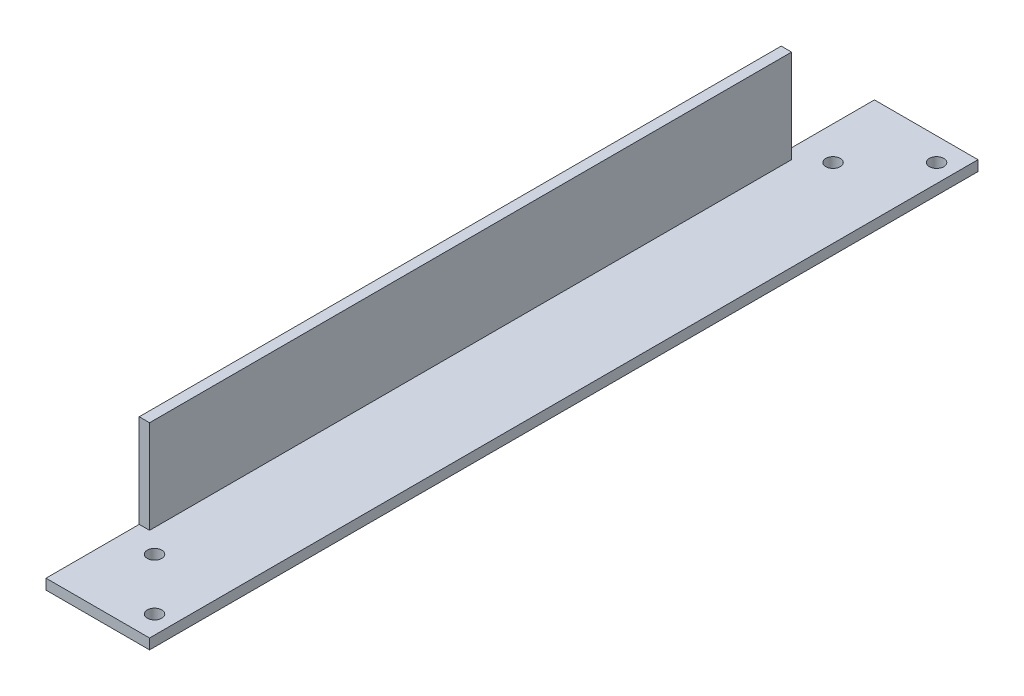
ISO-10303-21;
HEADER;
FILE_DESCRIPTION(('STEP AP214'),'2;1');
FILE_NAME('part.step','',(''),(''),'','','');
FILE_SCHEMA(('AUTOMOTIVE_DESIGN { 1 0 10303 214 1 1 1 1 }'));
ENDSEC;
DATA;
#1=APPLICATION_CONTEXT('core data for automotive mechanical design processes');
#2=APPLICATION_PROTOCOL_DEFINITION('international standard','automotive_design',2000,#1);
#3=PRODUCT_CONTEXT('',#1,'mechanical');
#4=PRODUCT('Part','Part','',(#3));
#5=PRODUCT_RELATED_PRODUCT_CATEGORY('part','',(#4));
#6=PRODUCT_DEFINITION_FORMATION('','',#4);
#7=PRODUCT_DEFINITION_CONTEXT('part definition',#1,'design');
#8=PRODUCT_DEFINITION('design','',#6,#7);
#9=PRODUCT_DEFINITION_SHAPE('','',#8);
#10=(LENGTH_UNIT() NAMED_UNIT(*) SI_UNIT(.MILLI.,.METRE.));
#11=(NAMED_UNIT(*) PLANE_ANGLE_UNIT() SI_UNIT($,.RADIAN.));
#12=(NAMED_UNIT(*) SI_UNIT($,.STERADIAN.) SOLID_ANGLE_UNIT());
#13=UNCERTAINTY_MEASURE_WITH_UNIT(LENGTH_MEASURE(1.E-05),#10,'distance_accuracy_value','');
#14=(GEOMETRIC_REPRESENTATION_CONTEXT(3) GLOBAL_UNCERTAINTY_ASSIGNED_CONTEXT((#13)) GLOBAL_UNIT_ASSIGNED_CONTEXT((#10,
#11,#12)) REPRESENTATION_CONTEXT('',''));
#15=CARTESIAN_POINT('',(0.,0.,0.));
#16=DIRECTION('',(0.,0.,1.));
#17=DIRECTION('',(1.,0.,0.));
#18=AXIS2_PLACEMENT_3D('',#15,#16,#17);
#19=CARTESIAN_POINT('',(0.,20.,160.));
#20=DIRECTION('',(1.,0.,0.));
#21=DIRECTION('',(0.,0.,-1.));
#22=AXIS2_PLACEMENT_3D('',#19,#20,#21);
#23=PLANE('',#22);
#24=DIRECTION('',(0.,0.,-1.));
#25=VECTOR('',#24,1.);
#26=CARTESIAN_POINT('',(0.,2.,160.));
#27=LINE('',#26,#25);
#28=CARTESIAN_POINT('',(0.,2.,160.));
#29=VERTEX_POINT('',#28);
#30=CARTESIAN_POINT('',(0.,2.,142.));
#31=VERTEX_POINT('',#30);
#32=EDGE_CURVE('E113',#29,#31,#27,.T.);
#33=ORIENTED_EDGE('',*,*,#32,.T.);
#34=DIRECTION('',(0.,1.,0.));
#35=VECTOR('',#34,1.);
#36=CARTESIAN_POINT('',(0.,20.,142.));
#37=LINE('',#36,#35);
#38=CARTESIAN_POINT('',(0.,20.,142.));
#39=VERTEX_POINT('',#38);
#40=EDGE_CURVE('E119',#31,#39,#37,.T.);
#41=ORIENTED_EDGE('',*,*,#40,.T.);
#42=DIRECTION('',(0.,0.,-1.));
#43=VECTOR('',#42,1.);
#44=CARTESIAN_POINT('',(0.,20.,160.));
#45=LINE('',#44,#43);
#46=CARTESIAN_POINT('',(0.,20.,18.));
#47=VERTEX_POINT('',#46);
#48=EDGE_CURVE('E158',#39,#47,#45,.T.);
#49=ORIENTED_EDGE('',*,*,#48,.T.);
#50=DIRECTION('',(0.,-1.,0.));
#51=VECTOR('',#50,1.);
#52=CARTESIAN_POINT('',(0.,20.,18.));
#53=LINE('',#52,#51);
#54=CARTESIAN_POINT('',(0.,2.,18.));
#55=VERTEX_POINT('',#54);
#56=EDGE_CURVE('E139',#47,#55,#53,.T.);
#57=ORIENTED_EDGE('',*,*,#56,.T.);
#58=DIRECTION('',(0.,0.,-1.));
#59=VECTOR('',#58,1.);
#60=CARTESIAN_POINT('',(0.,2.,0.));
#61=LINE('',#60,#59);
#62=CARTESIAN_POINT('',(0.,2.,0.));
#63=VERTEX_POINT('',#62);
#64=EDGE_CURVE('E142',#55,#63,#61,.T.);
#65=ORIENTED_EDGE('',*,*,#64,.T.);
#66=DIRECTION('',(0.,-1.,0.));
#67=VECTOR('',#66,1.);
#68=CARTESIAN_POINT('',(0.,20.,0.));
#69=LINE('',#68,#67);
#70=CARTESIAN_POINT('',(0.,0.,0.));
#71=VERTEX_POINT('',#70);
#72=EDGE_CURVE('E137',#63,#71,#69,.T.);
#73=ORIENTED_EDGE('',*,*,#72,.T.);
#74=DIRECTION('',(0.,0.,-1.));
#75=VECTOR('',#74,1.);
#76=CARTESIAN_POINT('',(0.,0.,160.));
#77=LINE('',#76,#75);
#78=CARTESIAN_POINT('',(0.,0.,160.));
#79=VERTEX_POINT('',#78);
#80=EDGE_CURVE('E11',#79,#71,#77,.T.);
#81=ORIENTED_EDGE('',*,*,#80,.F.);
#82=DIRECTION('',(0.,-1.,0.));
#83=VECTOR('',#82,1.);
#84=CARTESIAN_POINT('',(0.,20.,160.));
#85=LINE('',#84,#83);
#86=EDGE_CURVE('E79',#29,#79,#85,.T.);
#87=ORIENTED_EDGE('',*,*,#86,.F.);
#88=EDGE_LOOP('',(#33,#41,#49,#57,#65,#73,#81,#87));
#89=FACE_BOUND('',#88,.T.);
#90=ADVANCED_FACE('F39',(#89),#23,.F.);
#91=CARTESIAN_POINT('',(0.,0.,160.));
#92=DIRECTION('',(0.,1.,0.));
#93=DIRECTION('',(0.,0.,1.));
#94=AXIS2_PLACEMENT_3D('',#91,#92,#93);
#95=PLANE('',#94);
#96=CARTESIAN_POINT('',(16.48,0.,4.48000000000001));
#97=DIRECTION('',(0.,1.,0.));
#98=DIRECTION('',(1.,0.,0.));
#99=AXIS2_PLACEMENT_3D('',#96,#97,#98);
#100=CIRCLE('',#99,1.4);
#101=CARTESIAN_POINT('',(17.88,0.,4.48000000000001));
#102=VERTEX_POINT('',#101);
#103=EDGE_CURVE('E212',#102,#102,#100,.T.);
#104=ORIENTED_EDGE('',*,*,#103,.T.);
#105=EDGE_LOOP('',(#104));
#106=FACE_BOUND('',#105,.T.);
#107=CARTESIAN_POINT('',(16.48,0.,155.52));
#108=DIRECTION('',(0.,1.,0.));
#109=DIRECTION('',(-1.,0.,0.));
#110=AXIS2_PLACEMENT_3D('',#107,#108,#109);
#111=CIRCLE('',#110,1.40000000000002);
#112=CARTESIAN_POINT('',(15.08,0.,155.52));
#113=VERTEX_POINT('',#112);
#114=EDGE_CURVE('E216',#113,#113,#111,.T.);
#115=ORIENTED_EDGE('',*,*,#114,.T.);
#116=EDGE_LOOP('',(#115));
#117=FACE_BOUND('',#116,.T.);
#118=CARTESIAN_POINT('',(6.48,0.,14.48));
#119=DIRECTION('',(0.,1.,0.));
#120=DIRECTION('',(1.,0.,0.));
#121=AXIS2_PLACEMENT_3D('',#118,#119,#120);
#122=CIRCLE('',#121,1.4);
#123=CARTESIAN_POINT('',(7.88,0.,14.48));
#124=VERTEX_POINT('',#123);
#125=EDGE_CURVE('E220',#124,#124,#122,.T.);
#126=ORIENTED_EDGE('',*,*,#125,.T.);
#127=EDGE_LOOP('',(#126));
#128=FACE_BOUND('',#127,.T.);
#129=CARTESIAN_POINT('',(6.48,0.,145.52));
#130=DIRECTION('',(0.,1.,0.));
#131=DIRECTION('',(-1.,0.,0.));
#132=AXIS2_PLACEMENT_3D('',#129,#130,#131);
#133=CIRCLE('',#132,1.40000000000001);
#134=CARTESIAN_POINT('',(5.07999999999999,0.,145.52));
#135=VERTEX_POINT('',#134);
#136=EDGE_CURVE('E149',#135,#135,#133,.T.);
#137=ORIENTED_EDGE('',*,*,#136,.T.);
#138=EDGE_LOOP('',(#137));
#139=FACE_BOUND('',#138,.T.);
#140=DIRECTION('',(1.,0.,0.));
#141=VECTOR('',#140,1.);
#142=CARTESIAN_POINT('',(0.,0.,0.));
#143=LINE('',#142,#141);
#144=CARTESIAN_POINT('',(20.,0.,0.));
#145=VERTEX_POINT('',#144);
#146=EDGE_CURVE('E160',#71,#145,#143,.T.);
#147=ORIENTED_EDGE('',*,*,#146,.T.);
#148=DIRECTION('',(0.,0.,-1.));
#149=VECTOR('',#148,1.);
#150=CARTESIAN_POINT('',(20.,0.,160.));
#151=LINE('',#150,#149);
#152=CARTESIAN_POINT('',(20.,0.,160.));
#153=VERTEX_POINT('',#152);
#154=EDGE_CURVE('E46',#153,#145,#151,.T.);
#155=ORIENTED_EDGE('',*,*,#154,.F.);
#156=DIRECTION('',(1.,0.,0.));
#157=VECTOR('',#156,1.);
#158=CARTESIAN_POINT('',(0.,0.,160.));
#159=LINE('',#158,#157);
#160=EDGE_CURVE('E153',#79,#153,#159,.T.);
#161=ORIENTED_EDGE('',*,*,#160,.F.);
#162=ORIENTED_EDGE('',*,*,#80,.T.);
#163=EDGE_LOOP('',(#147,#155,#161,#162));
#164=FACE_BOUND('',#163,.T.);
#165=ADVANCED_FACE('F199',(#106,#117,#128,#139,#164),#95,.F.);
#166=CARTESIAN_POINT('',(20.,0.,160.));
#167=DIRECTION('',(-1.,0.,0.));
#168=DIRECTION('',(0.,0.,1.));
#169=AXIS2_PLACEMENT_3D('',#166,#167,#168);
#170=PLANE('',#169);
#171=DIRECTION('',(0.,1.,0.));
#172=VECTOR('',#171,1.);
#173=CARTESIAN_POINT('',(20.,0.,0.));
#174=LINE('',#173,#172);
#175=CARTESIAN_POINT('',(20.,2.,0.));
#176=VERTEX_POINT('',#175);
#177=EDGE_CURVE('E76',#145,#176,#174,.T.);
#178=ORIENTED_EDGE('',*,*,#177,.T.);
#179=DIRECTION('',(0.,0.,-1.));
#180=VECTOR('',#179,1.);
#181=CARTESIAN_POINT('',(20.,2.,160.));
#182=LINE('',#181,#180);
#183=CARTESIAN_POINT('',(20.,2.,160.));
#184=VERTEX_POINT('',#183);
#185=EDGE_CURVE('E169',#184,#176,#182,.T.);
#186=ORIENTED_EDGE('',*,*,#185,.F.);
#187=DIRECTION('',(0.,1.,0.));
#188=VECTOR('',#187,1.);
#189=CARTESIAN_POINT('',(20.,0.,160.));
#190=LINE('',#189,#188);
#191=EDGE_CURVE('E59',#153,#184,#190,.T.);
#192=ORIENTED_EDGE('',*,*,#191,.F.);
#193=ORIENTED_EDGE('',*,*,#154,.T.);
#194=EDGE_LOOP('',(#178,#186,#192,#193));
#195=FACE_BOUND('',#194,.T.);
#196=ADVANCED_FACE('F171',(#195),#170,.F.);
#197=CARTESIAN_POINT('',(20.,2.,160.));
#198=DIRECTION('',(0.,-1.,0.));
#199=DIRECTION('',(1.,0.,0.));
#200=AXIS2_PLACEMENT_3D('',#197,#198,#199);
#201=PLANE('',#200);
#202=CARTESIAN_POINT('',(16.48,2.,4.48000000000001));
#203=DIRECTION('',(0.,1.,0.));
#204=DIRECTION('',(1.,0.,0.));
#205=AXIS2_PLACEMENT_3D('',#202,#203,#204);
#206=CIRCLE('',#205,1.4);
#207=CARTESIAN_POINT('',(17.88,2.,4.48000000000001));
#208=VERTEX_POINT('',#207);
#209=EDGE_CURVE('E263',#208,#208,#206,.T.);
#210=ORIENTED_EDGE('',*,*,#209,.F.);
#211=EDGE_LOOP('',(#210));
#212=FACE_BOUND('',#211,.T.);
#213=CARTESIAN_POINT('',(16.48,2.,155.52));
#214=DIRECTION('',(0.,1.,0.));
#215=DIRECTION('',(-1.,0.,0.));
#216=AXIS2_PLACEMENT_3D('',#213,#214,#215);
#217=CIRCLE('',#216,1.40000000000002);
#218=CARTESIAN_POINT('',(15.08,2.,155.52));
#219=VERTEX_POINT('',#218);
#220=EDGE_CURVE('E257',#219,#219,#217,.T.);
#221=ORIENTED_EDGE('',*,*,#220,.F.);
#222=EDGE_LOOP('',(#221));
#223=FACE_BOUND('',#222,.T.);
#224=CARTESIAN_POINT('',(6.48,2.,14.48));
#225=DIRECTION('',(0.,1.,0.));
#226=DIRECTION('',(1.,0.,0.));
#227=AXIS2_PLACEMENT_3D('',#224,#225,#226);
#228=CIRCLE('',#227,1.4);
#229=CARTESIAN_POINT('',(7.88,2.,14.48));
#230=VERTEX_POINT('',#229);
#231=EDGE_CURVE('E253',#230,#230,#228,.T.);
#232=ORIENTED_EDGE('',*,*,#231,.F.);
#233=EDGE_LOOP('',(#232));
#234=FACE_BOUND('',#233,.T.);
#235=CARTESIAN_POINT('',(6.48,2.,145.52));
#236=DIRECTION('',(0.,1.,0.));
#237=DIRECTION('',(-1.,0.,0.));
#238=AXIS2_PLACEMENT_3D('',#235,#236,#237);
#239=CIRCLE('',#238,1.40000000000001);
#240=CARTESIAN_POINT('',(5.07999999999999,2.,145.52));
#241=VERTEX_POINT('',#240);
#242=EDGE_CURVE('E134',#241,#241,#239,.T.);
#243=ORIENTED_EDGE('',*,*,#242,.F.);
#244=EDGE_LOOP('',(#243));
#245=FACE_BOUND('',#244,.T.);
#246=DIRECTION('',(-1.,0.,0.));
#247=VECTOR('',#246,1.);
#248=CARTESIAN_POINT('',(20.,2.,0.));
#249=LINE('',#248,#247);
#250=EDGE_CURVE('E154',#176,#63,#249,.T.);
#251=ORIENTED_EDGE('',*,*,#250,.T.);
#252=ORIENTED_EDGE('',*,*,#64,.F.);
#253=DIRECTION('',(1.,0.,0.));
#254=VECTOR('',#253,1.);
#255=CARTESIAN_POINT('',(0.,2.,18.));
#256=LINE('',#255,#254);
#257=CARTESIAN_POINT('',(2.,2.,18.));
#258=VERTEX_POINT('',#257);
#259=EDGE_CURVE('E131',#55,#258,#256,.T.);
#260=ORIENTED_EDGE('',*,*,#259,.T.);
#261=DIRECTION('',(0.,0.,-1.));
#262=VECTOR('',#261,1.);
#263=CARTESIAN_POINT('',(2.,2.,160.));
#264=LINE('',#263,#262);
#265=CARTESIAN_POINT('',(2.,2.,142.));
#266=VERTEX_POINT('',#265);
#267=EDGE_CURVE('E115',#266,#258,#264,.T.);
#268=ORIENTED_EDGE('',*,*,#267,.F.);
#269=DIRECTION('',(1.,0.,0.));
#270=VECTOR('',#269,1.);
#271=CARTESIAN_POINT('',(0.,2.,142.));
#272=LINE('',#271,#270);
#273=EDGE_CURVE('E109',#31,#266,#272,.T.);
#274=ORIENTED_EDGE('',*,*,#273,.F.);
#275=ORIENTED_EDGE('',*,*,#32,.F.);
#276=DIRECTION('',(-1.,0.,0.));
#277=VECTOR('',#276,1.);
#278=CARTESIAN_POINT('',(20.,2.,160.));
#279=LINE('',#278,#277);
#280=EDGE_CURVE('E53',#184,#29,#279,.T.);
#281=ORIENTED_EDGE('',*,*,#280,.F.);
#282=ORIENTED_EDGE('',*,*,#185,.T.);
#283=EDGE_LOOP('',(#251,#252,#260,#268,#274,#275,#281,#282));
#284=FACE_BOUND('',#283,.T.);
#285=ADVANCED_FACE('F111',(#212,#223,#234,#245,#284),#201,.F.);
#286=CARTESIAN_POINT('',(2.,2.,160.));
#287=DIRECTION('',(-1.,0.,0.));
#288=DIRECTION('',(0.,0.,1.));
#289=AXIS2_PLACEMENT_3D('',#286,#287,#288);
#290=PLANE('',#289);
#291=DIRECTION('',(0.,0.,-1.));
#292=VECTOR('',#291,1.);
#293=CARTESIAN_POINT('',(2.,20.,160.));
#294=LINE('',#293,#292);
#295=CARTESIAN_POINT('',(2.,20.,142.));
#296=VERTEX_POINT('',#295);
#297=CARTESIAN_POINT('',(2.,20.,18.));
#298=VERTEX_POINT('',#297);
#299=EDGE_CURVE('E165',#296,#298,#294,.T.);
#300=ORIENTED_EDGE('',*,*,#299,.F.);
#301=DIRECTION('',(0.,1.,0.));
#302=VECTOR('',#301,1.);
#303=CARTESIAN_POINT('',(2.,20.,142.));
#304=LINE('',#303,#302);
#305=EDGE_CURVE('E129',#266,#296,#304,.T.);
#306=ORIENTED_EDGE('',*,*,#305,.F.);
#307=ORIENTED_EDGE('',*,*,#267,.T.);
#308=DIRECTION('',(0.,-1.,0.));
#309=VECTOR('',#308,1.);
#310=CARTESIAN_POINT('',(2.,20.,18.));
#311=LINE('',#310,#309);
#312=EDGE_CURVE('E143',#298,#258,#311,.T.);
#313=ORIENTED_EDGE('',*,*,#312,.F.);
#314=EDGE_LOOP('',(#300,#306,#307,#313));
#315=FACE_BOUND('',#314,.T.);
#316=ADVANCED_FACE('F187',(#315),#290,.F.);
#317=CARTESIAN_POINT('',(2.,20.,160.));
#318=DIRECTION('',(0.,-1.,0.));
#319=DIRECTION('',(0.,0.,-1.));
#320=AXIS2_PLACEMENT_3D('',#317,#318,#319);
#321=PLANE('',#320);
#322=ORIENTED_EDGE('',*,*,#48,.F.);
#323=DIRECTION('',(1.,0.,0.));
#324=VECTOR('',#323,1.);
#325=CARTESIAN_POINT('',(0.,20.,142.));
#326=LINE('',#325,#324);
#327=EDGE_CURVE('E118',#39,#296,#326,.T.);
#328=ORIENTED_EDGE('',*,*,#327,.T.);
#329=ORIENTED_EDGE('',*,*,#299,.T.);
#330=DIRECTION('',(1.,0.,0.));
#331=VECTOR('',#330,1.);
#332=CARTESIAN_POINT('',(0.,20.,18.));
#333=LINE('',#332,#331);
#334=EDGE_CURVE('E146',#47,#298,#333,.T.);
#335=ORIENTED_EDGE('',*,*,#334,.F.);
#336=EDGE_LOOP('',(#322,#328,#329,#335));
#337=FACE_BOUND('',#336,.T.);
#338=ADVANCED_FACE('F184',(#337),#321,.F.);
#339=CARTESIAN_POINT('',(0.,0.,160.));
#340=DIRECTION('',(0.,0.,1.));
#341=DIRECTION('',(1.,0.,0.));
#342=AXIS2_PLACEMENT_3D('',#339,#340,#341);
#343=PLANE('',#342);
#344=ORIENTED_EDGE('',*,*,#280,.T.);
#345=ORIENTED_EDGE('',*,*,#86,.T.);
#346=ORIENTED_EDGE('',*,*,#160,.T.);
#347=ORIENTED_EDGE('',*,*,#191,.T.);
#348=EDGE_LOOP('',(#344,#345,#346,#347));
#349=FACE_BOUND('',#348,.T.);
#350=ADVANCED_FACE('F194',(#349),#343,.T.);
#351=CARTESIAN_POINT('',(0.,0.,0.));
#352=DIRECTION('',(0.,0.,1.));
#353=DIRECTION('',(1.,0.,0.));
#354=AXIS2_PLACEMENT_3D('',#351,#352,#353);
#355=PLANE('',#354);
#356=ORIENTED_EDGE('',*,*,#72,.F.);
#357=ORIENTED_EDGE('',*,*,#250,.F.);
#358=ORIENTED_EDGE('',*,*,#177,.F.);
#359=ORIENTED_EDGE('',*,*,#146,.F.);
#360=EDGE_LOOP('',(#356,#357,#358,#359));
#361=FACE_BOUND('',#360,.T.);
#362=ADVANCED_FACE('F177',(#361),#355,.F.);
#363=CARTESIAN_POINT('',(0.,20.,18.));
#364=DIRECTION('',(0.,0.,1.));
#365=DIRECTION('',(1.,0.,0.));
#366=AXIS2_PLACEMENT_3D('',#363,#364,#365);
#367=PLANE('',#366);
#368=ORIENTED_EDGE('',*,*,#312,.T.);
#369=ORIENTED_EDGE('',*,*,#259,.F.);
#370=ORIENTED_EDGE('',*,*,#56,.F.);
#371=ORIENTED_EDGE('',*,*,#334,.T.);
#372=EDGE_LOOP('',(#368,#369,#370,#371));
#373=FACE_BOUND('',#372,.T.);
#374=ADVANCED_FACE('F181',(#373),#367,.F.);
#375=CARTESIAN_POINT('',(0.,20.,142.));
#376=DIRECTION('',(0.,0.,-1.));
#377=DIRECTION('',(-1.,0.,0.));
#378=AXIS2_PLACEMENT_3D('',#375,#376,#377);
#379=PLANE('',#378);
#380=ORIENTED_EDGE('',*,*,#305,.T.);
#381=ORIENTED_EDGE('',*,*,#327,.F.);
#382=ORIENTED_EDGE('',*,*,#40,.F.);
#383=ORIENTED_EDGE('',*,*,#273,.T.);
#384=EDGE_LOOP('',(#380,#381,#382,#383));
#385=FACE_BOUND('',#384,.T.);
#386=ADVANCED_FACE('F122',(#385),#379,.F.);
#387=CARTESIAN_POINT('',(6.48,0.,145.52));
#388=DIRECTION('',(0.,1.,0.));
#389=DIRECTION('',(-1.,0.,0.));
#390=AXIS2_PLACEMENT_3D('',#387,#388,#389);
#391=CYLINDRICAL_SURFACE('',#390,1.40000000000001);
#392=ORIENTED_EDGE('',*,*,#136,.F.);
#393=EDGE_LOOP('',(#392));
#394=FACE_BOUND('',#393,.T.);
#395=ORIENTED_EDGE('',*,*,#242,.T.);
#396=EDGE_LOOP('',(#395));
#397=FACE_BOUND('',#396,.T.);
#398=ADVANCED_FACE('F233',(#394,#397),#391,.F.);
#399=CARTESIAN_POINT('',(6.48,0.,14.48));
#400=DIRECTION('',(0.,1.,0.));
#401=DIRECTION('',(-1.,0.,0.));
#402=AXIS2_PLACEMENT_3D('',#399,#400,#401);
#403=CYLINDRICAL_SURFACE('',#402,1.4);
#404=ORIENTED_EDGE('',*,*,#125,.F.);
#405=EDGE_LOOP('',(#404));
#406=FACE_BOUND('',#405,.T.);
#407=ORIENTED_EDGE('',*,*,#231,.T.);
#408=EDGE_LOOP('',(#407));
#409=FACE_BOUND('',#408,.T.);
#410=ADVANCED_FACE('F236',(#406,#409),#403,.F.);
#411=CARTESIAN_POINT('',(16.48,0.,155.52));
#412=DIRECTION('',(0.,1.,0.));
#413=DIRECTION('',(-1.,0.,0.));
#414=AXIS2_PLACEMENT_3D('',#411,#412,#413);
#415=CYLINDRICAL_SURFACE('',#414,1.40000000000002);
#416=ORIENTED_EDGE('',*,*,#114,.F.);
#417=EDGE_LOOP('',(#416));
#418=FACE_BOUND('',#417,.T.);
#419=ORIENTED_EDGE('',*,*,#220,.T.);
#420=EDGE_LOOP('',(#419));
#421=FACE_BOUND('',#420,.T.);
#422=ADVANCED_FACE('F241',(#418,#421),#415,.F.);
#423=CARTESIAN_POINT('',(16.48,0.,4.48000000000001));
#424=DIRECTION('',(0.,1.,0.));
#425=DIRECTION('',(-1.,0.,0.));
#426=AXIS2_PLACEMENT_3D('',#423,#424,#425);
#427=CYLINDRICAL_SURFACE('',#426,1.4);
#428=ORIENTED_EDGE('',*,*,#103,.F.);
#429=EDGE_LOOP('',(#428));
#430=FACE_BOUND('',#429,.T.);
#431=ORIENTED_EDGE('',*,*,#209,.T.);
#432=EDGE_LOOP('',(#431));
#433=FACE_BOUND('',#432,.T.);
#434=ADVANCED_FACE('F238',(#430,#433),#427,.F.);
#435=CLOSED_SHELL('',(#90,#165,#196,#285,#316,#338,#350,#362,#374,#386,#398,#410,#422,#434));
#436=MANIFOLD_SOLID_BREP('B2',#435);
#437=ADVANCED_BREP_SHAPE_REPRESENTATION('',(#18,#436),#14);
#438=SHAPE_DEFINITION_REPRESENTATION(#9,#437);
ENDSEC;
END-ISO-10303-21;
